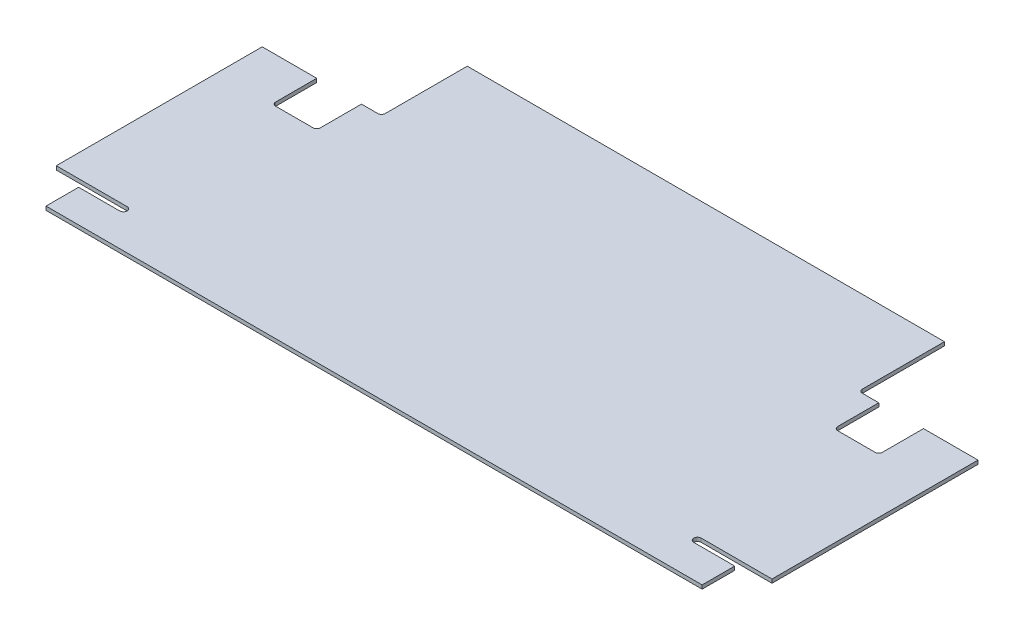
ISO-10303-21;
HEADER;
FILE_DESCRIPTION(('STEP AP214'),'2;1');
FILE_NAME('part.step','',(''),(''),'','','');
FILE_SCHEMA(('AUTOMOTIVE_DESIGN { 1 0 10303 214 1 1 1 1 }'));
ENDSEC;
DATA;
#1=APPLICATION_CONTEXT('core data for automotive mechanical design processes');
#2=APPLICATION_PROTOCOL_DEFINITION('international standard','automotive_design',2000,#1);
#3=PRODUCT_CONTEXT('',#1,'mechanical');
#4=PRODUCT('Part','Part','',(#3));
#5=PRODUCT_RELATED_PRODUCT_CATEGORY('part','',(#4));
#6=PRODUCT_DEFINITION_FORMATION('','',#4);
#7=PRODUCT_DEFINITION_CONTEXT('part definition',#1,'design');
#8=PRODUCT_DEFINITION('design','',#6,#7);
#9=PRODUCT_DEFINITION_SHAPE('','',#8);
#10=(LENGTH_UNIT() NAMED_UNIT(*) SI_UNIT(.MILLI.,.METRE.));
#11=(NAMED_UNIT(*) PLANE_ANGLE_UNIT() SI_UNIT($,.RADIAN.));
#12=(NAMED_UNIT(*) SI_UNIT($,.STERADIAN.) SOLID_ANGLE_UNIT());
#13=UNCERTAINTY_MEASURE_WITH_UNIT(LENGTH_MEASURE(1.E-05),#10,'distance_accuracy_value','');
#14=(GEOMETRIC_REPRESENTATION_CONTEXT(3) GLOBAL_UNCERTAINTY_ASSIGNED_CONTEXT((#13)) GLOBAL_UNIT_ASSIGNED_CONTEXT((#10,
#11,#12)) REPRESENTATION_CONTEXT('',''));
#15=CARTESIAN_POINT('',(0.,0.,0.));
#16=DIRECTION('',(0.,0.,1.));
#17=DIRECTION('',(1.,0.,0.));
#18=AXIS2_PLACEMENT_3D('',#15,#16,#17);
#19=CARTESIAN_POINT('',(304.8,3.175,152.4));
#20=DIRECTION('',(0.,1.,0.));
#21=DIRECTION('',(0.,0.,1.));
#22=AXIS2_PLACEMENT_3D('',#19,#20,#21);
#23=PLANE('',#22);
#24=DIRECTION('',(1.,0.,0.));
#25=VECTOR('',#24,1.);
#26=CARTESIAN_POINT('',(-304.8,3.175,152.4));
#27=LINE('',#26,#25);
#28=CARTESIAN_POINT('',(-279.4,3.175,152.4));
#29=VERTEX_POINT('',#28);
#30=CARTESIAN_POINT('',(279.4,3.175,152.4));
#31=VERTEX_POINT('',#30);
#32=EDGE_CURVE('E278',#29,#31,#27,.T.);
#33=ORIENTED_EDGE('',*,*,#32,.T.);
#34=DIRECTION('',(0.,0.,-1.));
#35=VECTOR('',#34,1.);
#36=CARTESIAN_POINT('',(279.4,3.175,152.4));
#37=LINE('',#36,#35);
#38=CARTESIAN_POINT('',(279.4,3.175,124.61875));
#39=VERTEX_POINT('',#38);
#40=EDGE_CURVE('E245',#31,#39,#37,.T.);
#41=ORIENTED_EDGE('',*,*,#40,.T.);
#42=DIRECTION('',(-1.,0.,0.));
#43=VECTOR('',#42,1.);
#44=CARTESIAN_POINT('',(279.4,3.175,124.61875));
#45=LINE('',#44,#43);
#46=CARTESIAN_POINT('',(244.475,3.175,124.61875));
#47=VERTEX_POINT('',#46);
#48=EDGE_CURVE('E366',#39,#47,#45,.T.);
#49=ORIENTED_EDGE('',*,*,#48,.T.);
#50=CARTESIAN_POINT('',(244.475,3.175,121.44375));
#51=DIRECTION('',(0.,1.,0.));
#52=DIRECTION('',(0.,0.,1.));
#53=AXIS2_PLACEMENT_3D('',#50,#51,#52);
#54=CIRCLE('',#53,3.175);
#55=CARTESIAN_POINT('',(241.3,3.175,121.44375));
#56=VERTEX_POINT('',#55);
#57=EDGE_CURVE('E52',#47,#56,#54,.F.);
#58=ORIENTED_EDGE('',*,*,#57,.T.);
#59=CARTESIAN_POINT('',(244.475,3.175,121.44375));
#60=DIRECTION('',(0.,1.,0.));
#61=DIRECTION('',(0.,0.,1.));
#62=AXIS2_PLACEMENT_3D('',#59,#60,#61);
#63=CIRCLE('',#62,3.175);
#64=CARTESIAN_POINT('',(244.475,3.175,118.26875));
#65=VERTEX_POINT('',#64);
#66=EDGE_CURVE('E39',#56,#65,#63,.F.);
#67=ORIENTED_EDGE('',*,*,#66,.T.);
#68=DIRECTION('',(1.,0.,0.));
#69=VECTOR('',#68,1.);
#70=CARTESIAN_POINT('',(304.8,3.175,118.26875));
#71=LINE('',#70,#69);
#72=CARTESIAN_POINT('',(304.8,3.175,118.26875));
#73=VERTEX_POINT('',#72);
#74=EDGE_CURVE('E259',#65,#73,#71,.T.);
#75=ORIENTED_EDGE('',*,*,#74,.T.);
#76=DIRECTION('',(0.,0.,-1.));
#77=VECTOR('',#76,1.);
#78=CARTESIAN_POINT('',(304.8,3.175,-152.4));
#79=LINE('',#78,#77);
#80=CARTESIAN_POINT('',(304.8,3.175,-57.1500000000001));
#81=VERTEX_POINT('',#80);
#82=EDGE_CURVE('E264',#73,#81,#79,.T.);
#83=ORIENTED_EDGE('',*,*,#82,.T.);
#84=DIRECTION('',(1.,0.,0.));
#85=VECTOR('',#84,1.);
#86=CARTESIAN_POINT('',(304.8,3.175,-57.1500000000001));
#87=LINE('',#86,#85);
#88=CARTESIAN_POINT('',(258.3815,3.175,-57.1500000000001));
#89=VERTEX_POINT('',#88);
#90=EDGE_CURVE('E469',#89,#81,#87,.T.);
#91=ORIENTED_EDGE('',*,*,#90,.F.);
#92=DIRECTION('',(0.,0.,-1.));
#93=VECTOR('',#92,1.);
#94=CARTESIAN_POINT('',(258.3815,3.175,-57.1500000000001));
#95=LINE('',#94,#93);
#96=CARTESIAN_POINT('',(258.3815,3.175,-22.2250000000001));
#97=VERTEX_POINT('',#96);
#98=EDGE_CURVE('E432',#97,#89,#95,.T.);
#99=ORIENTED_EDGE('',*,*,#98,.F.);
#100=CARTESIAN_POINT('',(255.2065,3.175,-22.2250000000001));
#101=DIRECTION('',(0.,1.,0.));
#102=DIRECTION('',(0.,0.,1.));
#103=AXIS2_PLACEMENT_3D('',#100,#101,#102);
#104=CIRCLE('',#103,3.175);
#105=CARTESIAN_POINT('',(255.2065,3.175,-19.0500000000001));
#106=VERTEX_POINT('',#105);
#107=EDGE_CURVE('E305',#97,#106,#104,.F.);
#108=ORIENTED_EDGE('',*,*,#107,.T.);
#109=DIRECTION('',(1.,0.,0.));
#110=VECTOR('',#109,1.);
#111=CARTESIAN_POINT('',(220.2815,3.175,-19.0500000000001));
#112=LINE('',#111,#110);
#113=CARTESIAN_POINT('',(223.4565,3.175,-19.0500000000001));
#114=VERTEX_POINT('',#113);
#115=EDGE_CURVE('E437',#114,#106,#112,.T.);
#116=ORIENTED_EDGE('',*,*,#115,.F.);
#117=CARTESIAN_POINT('',(223.4565,3.175,-22.2250000000001));
#118=DIRECTION('',(0.,1.,0.));
#119=DIRECTION('',(0.,0.,1.));
#120=AXIS2_PLACEMENT_3D('',#117,#118,#119);
#121=CIRCLE('',#120,3.175);
#122=CARTESIAN_POINT('',(220.2815,3.175,-22.2250000000001));
#123=VERTEX_POINT('',#122);
#124=EDGE_CURVE('E309',#114,#123,#121,.F.);
#125=ORIENTED_EDGE('',*,*,#124,.T.);
#126=DIRECTION('',(0.,0.,1.));
#127=VECTOR('',#126,1.);
#128=CARTESIAN_POINT('',(220.2815,3.175,-57.1500000000001));
#129=LINE('',#128,#127);
#130=CARTESIAN_POINT('',(220.2815,3.175,-57.1500000000001));
#131=VERTEX_POINT('',#130);
#132=EDGE_CURVE('E434',#131,#123,#129,.T.);
#133=ORIENTED_EDGE('',*,*,#132,.F.);
#134=CARTESIAN_POINT('',(206.375,3.175,-57.1500000000001));
#135=VERTEX_POINT('',#134);
#136=EDGE_CURVE('E470',#135,#131,#87,.T.);
#137=ORIENTED_EDGE('',*,*,#136,.F.);
#138=CARTESIAN_POINT('',(206.375,3.175,-60.3250000000001));
#139=DIRECTION('',(0.,1.,0.));
#140=DIRECTION('',(0.,0.,1.));
#141=AXIS2_PLACEMENT_3D('',#138,#139,#140);
#142=CIRCLE('',#141,3.175);
#143=CARTESIAN_POINT('',(203.2,3.175,-60.3250000000001));
#144=VERTEX_POINT('',#143);
#145=EDGE_CURVE('E285',#135,#144,#142,.F.);
#146=ORIENTED_EDGE('',*,*,#145,.T.);
#147=DIRECTION('',(0.,0.,1.));
#148=VECTOR('',#147,1.);
#149=CARTESIAN_POINT('',(203.2,3.175,-130.175));
#150=LINE('',#149,#148);
#151=CARTESIAN_POINT('',(203.2,3.175,-130.175));
#152=VERTEX_POINT('',#151);
#153=EDGE_CURVE('E466',#152,#144,#150,.T.);
#154=ORIENTED_EDGE('',*,*,#153,.F.);
#155=DIRECTION('',(1.,0.,0.));
#156=VECTOR('',#155,1.);
#157=CARTESIAN_POINT('',(-203.2,3.175,-130.175));
#158=LINE('',#157,#156);
#159=CARTESIAN_POINT('',(-203.2,3.175,-130.175));
#160=VERTEX_POINT('',#159);
#161=EDGE_CURVE('E463',#160,#152,#158,.T.);
#162=ORIENTED_EDGE('',*,*,#161,.F.);
#163=DIRECTION('',(0.,0.,-1.));
#164=VECTOR('',#163,1.);
#165=CARTESIAN_POINT('',(-203.2,3.175,-130.175));
#166=LINE('',#165,#164);
#167=CARTESIAN_POINT('',(-203.2,3.175,-60.325));
#168=VERTEX_POINT('',#167);
#169=EDGE_CURVE('E461',#168,#160,#166,.T.);
#170=ORIENTED_EDGE('',*,*,#169,.F.);
#171=CARTESIAN_POINT('',(-206.375,3.175,-60.325));
#172=DIRECTION('',(0.,1.,0.));
#173=DIRECTION('',(0.,0.,1.));
#174=AXIS2_PLACEMENT_3D('',#171,#172,#173);
#175=CIRCLE('',#174,3.175);
#176=CARTESIAN_POINT('',(-206.375,3.175,-57.15));
#177=VERTEX_POINT('',#176);
#178=EDGE_CURVE('E290',#168,#177,#175,.F.);
#179=ORIENTED_EDGE('',*,*,#178,.T.);
#180=DIRECTION('',(1.,0.,0.));
#181=VECTOR('',#180,1.);
#182=CARTESIAN_POINT('',(-304.8,3.175,-57.15));
#183=LINE('',#182,#181);
#184=CARTESIAN_POINT('',(-220.2815,3.175,-57.15));
#185=VERTEX_POINT('',#184);
#186=EDGE_CURVE('E457',#185,#177,#183,.T.);
#187=ORIENTED_EDGE('',*,*,#186,.F.);
#188=DIRECTION('',(0.,0.,1.));
#189=VECTOR('',#188,1.);
#190=CARTESIAN_POINT('',(-220.2815,3.175,-57.1500000000001));
#191=LINE('',#190,#189);
#192=CARTESIAN_POINT('',(-220.2815,3.175,-22.2250000000001));
#193=VERTEX_POINT('',#192);
#194=EDGE_CURVE('E412',#185,#193,#191,.T.);
#195=ORIENTED_EDGE('',*,*,#194,.T.);
#196=CARTESIAN_POINT('',(-223.4565,3.175,-22.2250000000001));
#197=DIRECTION('',(0.,1.,0.));
#198=DIRECTION('',(0.,0.,1.));
#199=AXIS2_PLACEMENT_3D('',#196,#197,#198);
#200=CIRCLE('',#199,3.175);
#201=CARTESIAN_POINT('',(-223.4565,3.175,-19.0500000000001));
#202=VERTEX_POINT('',#201);
#203=EDGE_CURVE('E327',#193,#202,#200,.F.);
#204=ORIENTED_EDGE('',*,*,#203,.T.);
#205=DIRECTION('',(-1.,0.,0.));
#206=VECTOR('',#205,1.);
#207=CARTESIAN_POINT('',(-220.2815,3.175,-19.0500000000001));
#208=LINE('',#207,#206);
#209=CARTESIAN_POINT('',(-255.2065,3.175,-19.0500000000001));
#210=VERTEX_POINT('',#209);
#211=EDGE_CURVE('E409',#202,#210,#208,.T.);
#212=ORIENTED_EDGE('',*,*,#211,.T.);
#213=CARTESIAN_POINT('',(-255.2065,3.175,-22.2250000000001));
#214=DIRECTION('',(0.,1.,0.));
#215=DIRECTION('',(0.,0.,1.));
#216=AXIS2_PLACEMENT_3D('',#213,#214,#215);
#217=CIRCLE('',#216,3.175);
#218=CARTESIAN_POINT('',(-258.3815,3.175,-22.2250000000001));
#219=VERTEX_POINT('',#218);
#220=EDGE_CURVE('E323',#210,#219,#217,.F.);
#221=ORIENTED_EDGE('',*,*,#220,.T.);
#222=DIRECTION('',(0.,0.,-1.));
#223=VECTOR('',#222,1.);
#224=CARTESIAN_POINT('',(-258.3815,3.175,-57.1500000000001));
#225=LINE('',#224,#223);
#226=CARTESIAN_POINT('',(-258.3815,3.175,-57.1500000000001));
#227=VERTEX_POINT('',#226);
#228=EDGE_CURVE('E407',#219,#227,#225,.T.);
#229=ORIENTED_EDGE('',*,*,#228,.T.);
#230=CARTESIAN_POINT('',(-304.8,3.175,-57.15));
#231=VERTEX_POINT('',#230);
#232=EDGE_CURVE('E458',#231,#227,#183,.T.);
#233=ORIENTED_EDGE('',*,*,#232,.F.);
#234=DIRECTION('',(0.,0.,1.));
#235=VECTOR('',#234,1.);
#236=CARTESIAN_POINT('',(-304.8,3.175,-152.4));
#237=LINE('',#236,#235);
#238=CARTESIAN_POINT('',(-304.8,3.175,118.26875));
#239=VERTEX_POINT('',#238);
#240=EDGE_CURVE('E267',#231,#239,#237,.T.);
#241=ORIENTED_EDGE('',*,*,#240,.T.);
#242=DIRECTION('',(-1.,0.,0.));
#243=VECTOR('',#242,1.);
#244=CARTESIAN_POINT('',(-304.8,3.175,118.26875));
#245=LINE('',#244,#243);
#246=CARTESIAN_POINT('',(-244.475,3.175,118.26875));
#247=VERTEX_POINT('',#246);
#248=EDGE_CURVE('E394',#247,#239,#245,.T.);
#249=ORIENTED_EDGE('',*,*,#248,.F.);
#250=CARTESIAN_POINT('',(-244.475,3.175,121.44375));
#251=DIRECTION('',(0.,1.,0.));
#252=DIRECTION('',(0.,0.,1.));
#253=AXIS2_PLACEMENT_3D('',#250,#251,#252);
#254=CIRCLE('',#253,3.175);
#255=CARTESIAN_POINT('',(-241.3,3.175,121.44375));
#256=VERTEX_POINT('',#255);
#257=EDGE_CURVE('E340',#247,#256,#254,.F.);
#258=ORIENTED_EDGE('',*,*,#257,.T.);
#259=CARTESIAN_POINT('',(-244.475,3.175,121.44375));
#260=DIRECTION('',(0.,1.,0.));
#261=DIRECTION('',(0.,0.,1.));
#262=AXIS2_PLACEMENT_3D('',#259,#260,#261);
#263=CIRCLE('',#262,3.175);
#264=CARTESIAN_POINT('',(-244.475,3.175,124.61875));
#265=VERTEX_POINT('',#264);
#266=EDGE_CURVE('E336',#256,#265,#263,.F.);
#267=ORIENTED_EDGE('',*,*,#266,.T.);
#268=DIRECTION('',(1.,0.,0.));
#269=VECTOR('',#268,1.);
#270=CARTESIAN_POINT('',(-279.4,3.175,124.61875));
#271=LINE('',#270,#269);
#272=CARTESIAN_POINT('',(-279.4,3.175,124.61875));
#273=VERTEX_POINT('',#272);
#274=EDGE_CURVE('E391',#273,#265,#271,.T.);
#275=ORIENTED_EDGE('',*,*,#274,.F.);
#276=DIRECTION('',(0.,0.,-1.));
#277=VECTOR('',#276,1.);
#278=CARTESIAN_POINT('',(-279.4,3.175,152.4));
#279=LINE('',#278,#277);
#280=EDGE_CURVE('E388',#29,#273,#279,.T.);
#281=ORIENTED_EDGE('',*,*,#280,.F.);
#282=EDGE_LOOP('',(#33,#41,#49,#58,#67,#75,#83,#91,#99,#108,#116,#125,#133,#137,#146,#154,#162,
#170,#179,#187,#195,#204,#212,#221,#229,#233,#241,#249,#258,#267,#275,#281));
#283=FACE_BOUND('',#282,.T.);
#284=ADVANCED_FACE('F30',(#283),#23,.T.);
#285=CARTESIAN_POINT('',(304.8,0.,152.4));
#286=DIRECTION('',(0.,1.,0.));
#287=DIRECTION('',(0.,0.,1.));
#288=AXIS2_PLACEMENT_3D('',#285,#286,#287);
#289=PLANE('',#288);
#290=DIRECTION('',(0.,0.,1.));
#291=VECTOR('',#290,1.);
#292=CARTESIAN_POINT('',(279.4,0.,152.4));
#293=LINE('',#292,#291);
#294=CARTESIAN_POINT('',(279.4,0.,124.61875));
#295=VERTEX_POINT('',#294);
#296=CARTESIAN_POINT('',(279.4,0.,152.4));
#297=VERTEX_POINT('',#296);
#298=EDGE_CURVE('E242',#295,#297,#293,.T.);
#299=ORIENTED_EDGE('',*,*,#298,.T.);
#300=DIRECTION('',(1.,0.,0.));
#301=VECTOR('',#300,1.);
#302=CARTESIAN_POINT('',(-304.8,0.,152.4));
#303=LINE('',#302,#301);
#304=CARTESIAN_POINT('',(-279.4,0.,152.4));
#305=VERTEX_POINT('',#304);
#306=EDGE_CURVE('E256',#305,#297,#303,.T.);
#307=ORIENTED_EDGE('',*,*,#306,.F.);
#308=DIRECTION('',(0.,0.,1.));
#309=VECTOR('',#308,1.);
#310=CARTESIAN_POINT('',(-279.4,0.,152.4));
#311=LINE('',#310,#309);
#312=CARTESIAN_POINT('',(-279.4,0.,124.61875));
#313=VERTEX_POINT('',#312);
#314=EDGE_CURVE('E348',#313,#305,#311,.T.);
#315=ORIENTED_EDGE('',*,*,#314,.F.);
#316=DIRECTION('',(-1.,0.,0.));
#317=VECTOR('',#316,1.);
#318=CARTESIAN_POINT('',(-279.4,0.,124.61875));
#319=LINE('',#318,#317);
#320=CARTESIAN_POINT('',(-244.475,0.,124.61875));
#321=VERTEX_POINT('',#320);
#322=EDGE_CURVE('E383',#321,#313,#319,.T.);
#323=ORIENTED_EDGE('',*,*,#322,.F.);
#324=CARTESIAN_POINT('',(-244.475,0.,121.44375));
#325=DIRECTION('',(0.,1.,0.));
#326=DIRECTION('',(0.,0.,1.));
#327=AXIS2_PLACEMENT_3D('',#324,#325,#326);
#328=CIRCLE('',#327,3.175);
#329=CARTESIAN_POINT('',(-241.3,0.,121.44375));
#330=VERTEX_POINT('',#329);
#331=EDGE_CURVE('E338',#321,#330,#328,.T.);
#332=ORIENTED_EDGE('',*,*,#331,.T.);
#333=CARTESIAN_POINT('',(-244.475,0.,121.44375));
#334=DIRECTION('',(0.,1.,0.));
#335=DIRECTION('',(0.,0.,1.));
#336=AXIS2_PLACEMENT_3D('',#333,#334,#335);
#337=CIRCLE('',#336,3.175);
#338=CARTESIAN_POINT('',(-244.475,0.,118.26875));
#339=VERTEX_POINT('',#338);
#340=EDGE_CURVE('E342',#330,#339,#337,.T.);
#341=ORIENTED_EDGE('',*,*,#340,.T.);
#342=DIRECTION('',(1.,0.,0.));
#343=VECTOR('',#342,1.);
#344=CARTESIAN_POINT('',(-304.8,0.,118.26875));
#345=LINE('',#344,#343);
#346=CARTESIAN_POINT('',(-304.8,0.,118.26875));
#347=VERTEX_POINT('',#346);
#348=EDGE_CURVE('E385',#347,#339,#345,.T.);
#349=ORIENTED_EDGE('',*,*,#348,.F.);
#350=DIRECTION('',(0.,0.,1.));
#351=VECTOR('',#350,1.);
#352=CARTESIAN_POINT('',(-304.8,0.,-152.4));
#353=LINE('',#352,#351);
#354=CARTESIAN_POINT('',(-304.8,0.,-57.15));
#355=VERTEX_POINT('',#354);
#356=EDGE_CURVE('E265',#355,#347,#353,.T.);
#357=ORIENTED_EDGE('',*,*,#356,.F.);
#358=DIRECTION('',(-1.,0.,0.));
#359=VECTOR('',#358,1.);
#360=CARTESIAN_POINT('',(-304.8,0.,-57.15));
#361=LINE('',#360,#359);
#362=CARTESIAN_POINT('',(-258.3815,0.,-57.15));
#363=VERTEX_POINT('',#362);
#364=EDGE_CURVE('E477',#363,#355,#361,.T.);
#365=ORIENTED_EDGE('',*,*,#364,.F.);
#366=DIRECTION('',(0.,0.,1.));
#367=VECTOR('',#366,1.);
#368=CARTESIAN_POINT('',(-258.3815,0.,-57.1500000000001));
#369=LINE('',#368,#367);
#370=CARTESIAN_POINT('',(-258.3815,0.,-22.2250000000001));
#371=VERTEX_POINT('',#370);
#372=EDGE_CURVE('E404',#363,#371,#369,.T.);
#373=ORIENTED_EDGE('',*,*,#372,.T.);
#374=CARTESIAN_POINT('',(-255.2065,0.,-22.2250000000001));
#375=DIRECTION('',(0.,1.,0.));
#376=DIRECTION('',(0.,0.,1.));
#377=AXIS2_PLACEMENT_3D('',#374,#375,#376);
#378=CIRCLE('',#377,3.175);
#379=CARTESIAN_POINT('',(-255.2065,0.,-19.0500000000001));
#380=VERTEX_POINT('',#379);
#381=EDGE_CURVE('E325',#371,#380,#378,.T.);
#382=ORIENTED_EDGE('',*,*,#381,.T.);
#383=DIRECTION('',(1.,0.,0.));
#384=VECTOR('',#383,1.);
#385=CARTESIAN_POINT('',(-220.2815,0.,-19.0500000000001));
#386=LINE('',#385,#384);
#387=CARTESIAN_POINT('',(-223.4565,0.,-19.0500000000001));
#388=VERTEX_POINT('',#387);
#389=EDGE_CURVE('E419',#380,#388,#386,.T.);
#390=ORIENTED_EDGE('',*,*,#389,.T.);
#391=CARTESIAN_POINT('',(-223.4565,0.,-22.2250000000001));
#392=DIRECTION('',(0.,1.,0.));
#393=DIRECTION('',(0.,0.,1.));
#394=AXIS2_PLACEMENT_3D('',#391,#392,#393);
#395=CIRCLE('',#394,3.175);
#396=CARTESIAN_POINT('',(-220.2815,0.,-22.2250000000001));
#397=VERTEX_POINT('',#396);
#398=EDGE_CURVE('E329',#388,#397,#395,.T.);
#399=ORIENTED_EDGE('',*,*,#398,.T.);
#400=DIRECTION('',(0.,0.,-1.));
#401=VECTOR('',#400,1.);
#402=CARTESIAN_POINT('',(-220.2815,0.,-57.1500000000001));
#403=LINE('',#402,#401);
#404=CARTESIAN_POINT('',(-220.2815,0.,-57.15));
#405=VERTEX_POINT('',#404);
#406=EDGE_CURVE('E399',#397,#405,#403,.T.);
#407=ORIENTED_EDGE('',*,*,#406,.T.);
#408=CARTESIAN_POINT('',(-206.375,0.,-57.15));
#409=VERTEX_POINT('',#408);
#410=EDGE_CURVE('E484',#409,#405,#361,.T.);
#411=ORIENTED_EDGE('',*,*,#410,.F.);
#412=CARTESIAN_POINT('',(-206.375,0.,-60.325));
#413=DIRECTION('',(0.,1.,0.));
#414=DIRECTION('',(0.,0.,1.));
#415=AXIS2_PLACEMENT_3D('',#412,#413,#414);
#416=CIRCLE('',#415,3.175);
#417=CARTESIAN_POINT('',(-203.2,0.,-60.325));
#418=VERTEX_POINT('',#417);
#419=EDGE_CURVE('E293',#409,#418,#416,.T.);
#420=ORIENTED_EDGE('',*,*,#419,.T.);
#421=DIRECTION('',(0.,0.,1.));
#422=VECTOR('',#421,1.);
#423=CARTESIAN_POINT('',(-203.2,0.,-130.175));
#424=LINE('',#423,#422);
#425=CARTESIAN_POINT('',(-203.2,0.,-130.175));
#426=VERTEX_POINT('',#425);
#427=EDGE_CURVE('E443',#426,#418,#424,.T.);
#428=ORIENTED_EDGE('',*,*,#427,.F.);
#429=DIRECTION('',(-1.,0.,0.));
#430=VECTOR('',#429,1.);
#431=CARTESIAN_POINT('',(-203.2,0.,-130.175));
#432=LINE('',#431,#430);
#433=CARTESIAN_POINT('',(203.2,0.,-130.175));
#434=VERTEX_POINT('',#433);
#435=EDGE_CURVE('E448',#434,#426,#432,.T.);
#436=ORIENTED_EDGE('',*,*,#435,.F.);
#437=DIRECTION('',(0.,0.,-1.));
#438=VECTOR('',#437,1.);
#439=CARTESIAN_POINT('',(203.2,0.,-130.175));
#440=LINE('',#439,#438);
#441=CARTESIAN_POINT('',(203.2,0.,-60.3250000000001));
#442=VERTEX_POINT('',#441);
#443=EDGE_CURVE('E451',#442,#434,#440,.T.);
#444=ORIENTED_EDGE('',*,*,#443,.F.);
#445=CARTESIAN_POINT('',(206.375,0.,-60.3250000000001));
#446=DIRECTION('',(0.,1.,0.));
#447=DIRECTION('',(0.,0.,1.));
#448=AXIS2_PLACEMENT_3D('',#445,#446,#447);
#449=CIRCLE('',#448,3.175);
#450=CARTESIAN_POINT('',(206.375,0.,-57.1500000000001));
#451=VERTEX_POINT('',#450);
#452=EDGE_CURVE('E287',#442,#451,#449,.T.);
#453=ORIENTED_EDGE('',*,*,#452,.T.);
#454=DIRECTION('',(-1.,0.,0.));
#455=VECTOR('',#454,1.);
#456=CARTESIAN_POINT('',(304.8,0.,-57.1500000000001));
#457=LINE('',#456,#455);
#458=CARTESIAN_POINT('',(220.2815,0.,-57.1500000000001));
#459=VERTEX_POINT('',#458);
#460=EDGE_CURVE('E453',#459,#451,#457,.T.);
#461=ORIENTED_EDGE('',*,*,#460,.F.);
#462=DIRECTION('',(0.,0.,-1.));
#463=VECTOR('',#462,1.);
#464=CARTESIAN_POINT('',(220.2815,0.,-57.1500000000001));
#465=LINE('',#464,#463);
#466=CARTESIAN_POINT('',(220.2815,0.,-22.2250000000001));
#467=VERTEX_POINT('',#466);
#468=EDGE_CURVE('E424',#467,#459,#465,.T.);
#469=ORIENTED_EDGE('',*,*,#468,.F.);
#470=CARTESIAN_POINT('',(223.4565,0.,-22.2250000000001));
#471=DIRECTION('',(0.,1.,0.));
#472=DIRECTION('',(0.,0.,1.));
#473=AXIS2_PLACEMENT_3D('',#470,#471,#472);
#474=CIRCLE('',#473,3.175);
#475=CARTESIAN_POINT('',(223.4565,0.,-19.0500000000001));
#476=VERTEX_POINT('',#475);
#477=EDGE_CURVE('E311',#467,#476,#474,.T.);
#478=ORIENTED_EDGE('',*,*,#477,.T.);
#479=DIRECTION('',(-1.,0.,0.));
#480=VECTOR('',#479,1.);
#481=CARTESIAN_POINT('',(220.2815,0.,-19.0500000000001));
#482=LINE('',#481,#480);
#483=CARTESIAN_POINT('',(255.2065,0.,-19.0500000000001));
#484=VERTEX_POINT('',#483);
#485=EDGE_CURVE('E426',#484,#476,#482,.T.);
#486=ORIENTED_EDGE('',*,*,#485,.F.);
#487=CARTESIAN_POINT('',(255.2065,0.,-22.2250000000001));
#488=DIRECTION('',(0.,1.,0.));
#489=DIRECTION('',(0.,0.,1.));
#490=AXIS2_PLACEMENT_3D('',#487,#488,#489);
#491=CIRCLE('',#490,3.175);
#492=CARTESIAN_POINT('',(258.3815,0.,-22.2250000000001));
#493=VERTEX_POINT('',#492);
#494=EDGE_CURVE('E307',#484,#493,#491,.T.);
#495=ORIENTED_EDGE('',*,*,#494,.T.);
#496=DIRECTION('',(0.,0.,1.));
#497=VECTOR('',#496,1.);
#498=CARTESIAN_POINT('',(258.3815,0.,-57.1500000000001));
#499=LINE('',#498,#497);
#500=CARTESIAN_POINT('',(258.3815,0.,-57.1500000000001));
#501=VERTEX_POINT('',#500);
#502=EDGE_CURVE('E429',#501,#493,#499,.T.);
#503=ORIENTED_EDGE('',*,*,#502,.F.);
#504=CARTESIAN_POINT('',(304.8,0.,-57.1500000000001));
#505=VERTEX_POINT('',#504);
#506=EDGE_CURVE('E454',#505,#501,#457,.T.);
#507=ORIENTED_EDGE('',*,*,#506,.F.);
#508=DIRECTION('',(0.,0.,-1.));
#509=VECTOR('',#508,1.);
#510=CARTESIAN_POINT('',(304.8,0.,-152.4));
#511=LINE('',#510,#509);
#512=CARTESIAN_POINT('',(304.8,0.,118.26875));
#513=VERTEX_POINT('',#512);
#514=EDGE_CURVE('E270',#513,#505,#511,.T.);
#515=ORIENTED_EDGE('',*,*,#514,.F.);
#516=DIRECTION('',(-1.,0.,0.));
#517=VECTOR('',#516,1.);
#518=CARTESIAN_POINT('',(304.8,0.,118.26875));
#519=LINE('',#518,#517);
#520=CARTESIAN_POINT('',(244.475,0.,118.26875));
#521=VERTEX_POINT('',#520);
#522=EDGE_CURVE('E250',#513,#521,#519,.T.);
#523=ORIENTED_EDGE('',*,*,#522,.T.);
#524=CARTESIAN_POINT('',(244.475,0.,121.44375));
#525=DIRECTION('',(0.,1.,0.));
#526=DIRECTION('',(0.,0.,1.));
#527=AXIS2_PLACEMENT_3D('',#524,#525,#526);
#528=CIRCLE('',#527,3.175);
#529=CARTESIAN_POINT('',(241.3,0.,121.44375));
#530=VERTEX_POINT('',#529);
#531=EDGE_CURVE('E11',#521,#530,#528,.T.);
#532=ORIENTED_EDGE('',*,*,#531,.T.);
#533=CARTESIAN_POINT('',(244.475,0.,121.44375));
#534=DIRECTION('',(0.,1.,0.));
#535=DIRECTION('',(0.,0.,1.));
#536=AXIS2_PLACEMENT_3D('',#533,#534,#535);
#537=CIRCLE('',#536,3.175);
#538=CARTESIAN_POINT('',(244.475,0.,124.61875));
#539=VERTEX_POINT('',#538);
#540=EDGE_CURVE('E354',#530,#539,#537,.T.);
#541=ORIENTED_EDGE('',*,*,#540,.T.);
#542=DIRECTION('',(1.,0.,0.));
#543=VECTOR('',#542,1.);
#544=CARTESIAN_POINT('',(279.4,0.,124.61875));
#545=LINE('',#544,#543);
#546=EDGE_CURVE('E258',#539,#295,#545,.T.);
#547=ORIENTED_EDGE('',*,*,#546,.T.);
#548=EDGE_LOOP('',(#299,#307,#315,#323,#332,#341,#349,#357,#365,#373,#382,#390,#399,#407,#411,
#420,#428,#436,#444,#453,#461,#469,#478,#486,#495,#503,#507,#515,#523,#532,#541,#547));
#549=FACE_BOUND('',#548,.T.);
#550=ADVANCED_FACE('F254',(#549),#289,.F.);
#551=CARTESIAN_POINT('',(304.8,3.175,-152.4));
#552=DIRECTION('',(-1.,0.,0.));
#553=DIRECTION('',(0.,0.,1.));
#554=AXIS2_PLACEMENT_3D('',#551,#552,#553);
#555=PLANE('',#554);
#556=DIRECTION('',(0.,1.,0.));
#557=VECTOR('',#556,1.);
#558=CARTESIAN_POINT('',(304.8,-0.00100000000000013,118.26875));
#559=LINE('',#558,#557);
#560=EDGE_CURVE('E364',#513,#73,#559,.T.);
#561=ORIENTED_EDGE('',*,*,#560,.F.);
#562=ORIENTED_EDGE('',*,*,#514,.T.);
#563=DIRECTION('',(0.,1.,0.));
#564=VECTOR('',#563,1.);
#565=CARTESIAN_POINT('',(304.8,-0.00100000000000013,-57.1500000000001));
#566=LINE('',#565,#564);
#567=EDGE_CURVE('E474',#505,#81,#566,.T.);
#568=ORIENTED_EDGE('',*,*,#567,.T.);
#569=ORIENTED_EDGE('',*,*,#82,.F.);
#570=EDGE_LOOP('',(#561,#562,#568,#569));
#571=FACE_BOUND('',#570,.T.);
#572=ADVANCED_FACE('F492',(#571),#555,.F.);
#573=CARTESIAN_POINT('',(-304.8,3.175,152.4));
#574=DIRECTION('',(0.,0.,-1.));
#575=DIRECTION('',(-1.,0.,0.));
#576=AXIS2_PLACEMENT_3D('',#573,#574,#575);
#577=PLANE('',#576);
#578=DIRECTION('',(0.,1.,0.));
#579=VECTOR('',#578,1.);
#580=CARTESIAN_POINT('',(279.4,-0.00100000000000013,152.4));
#581=LINE('',#580,#579);
#582=EDGE_CURVE('E239',#297,#31,#581,.T.);
#583=ORIENTED_EDGE('',*,*,#582,.T.);
#584=ORIENTED_EDGE('',*,*,#32,.F.);
#585=DIRECTION('',(0.,1.,0.));
#586=VECTOR('',#585,1.);
#587=CARTESIAN_POINT('',(-279.4,-0.00100000000000013,152.4));
#588=LINE('',#587,#586);
#589=EDGE_CURVE('E263',#305,#29,#588,.T.);
#590=ORIENTED_EDGE('',*,*,#589,.F.);
#591=ORIENTED_EDGE('',*,*,#306,.T.);
#592=EDGE_LOOP('',(#583,#584,#590,#591));
#593=FACE_BOUND('',#592,.T.);
#594=ADVANCED_FACE('F262',(#593),#577,.F.);
#595=CARTESIAN_POINT('',(-304.8,-0.00100000000000013,-57.15));
#596=DIRECTION('',(0.,0.,1.));
#597=DIRECTION('',(1.,0.,0.));
#598=AXIS2_PLACEMENT_3D('',#595,#596,#597);
#599=PLANE('',#598);
#600=DIRECTION('',(0.,1.,0.));
#601=VECTOR('',#600,1.);
#602=CARTESIAN_POINT('',(-258.3815,-0.00100000000000013,-57.1500000000001));
#603=LINE('',#602,#601);
#604=EDGE_CURVE('E416',#363,#227,#603,.T.);
#605=ORIENTED_EDGE('',*,*,#604,.F.);
#606=ORIENTED_EDGE('',*,*,#364,.T.);
#607=DIRECTION('',(0.,1.,0.));
#608=VECTOR('',#607,1.);
#609=CARTESIAN_POINT('',(-304.8,-0.00100000000000013,-57.15));
#610=LINE('',#609,#608);
#611=EDGE_CURVE('E473',#355,#231,#610,.T.);
#612=ORIENTED_EDGE('',*,*,#611,.T.);
#613=ORIENTED_EDGE('',*,*,#232,.T.);
#614=EDGE_LOOP('',(#605,#606,#612,#613));
#615=FACE_BOUND('',#614,.T.);
#616=ADVANCED_FACE('F587',(#615),#599,.F.);
#617=DIRECTION('',(0.,1.,0.));
#618=VECTOR('',#617,1.);
#619=CARTESIAN_POINT('',(-220.2815,-0.00100000000000013,-57.1500000000001));
#620=LINE('',#619,#618);
#621=EDGE_CURVE('E415',#405,#185,#620,.T.);
#622=ORIENTED_EDGE('',*,*,#621,.T.);
#623=ORIENTED_EDGE('',*,*,#186,.T.);
#624=DIRECTION('',(0.,1.,0.));
#625=VECTOR('',#624,1.);
#626=CARTESIAN_POINT('',(-206.375,0.,-57.15));
#627=LINE('',#626,#625);
#628=EDGE_CURVE('E283',#177,#409,#627,.F.);
#629=ORIENTED_EDGE('',*,*,#628,.T.);
#630=ORIENTED_EDGE('',*,*,#410,.T.);
#631=EDGE_LOOP('',(#622,#623,#629,#630));
#632=FACE_BOUND('',#631,.T.);
#633=ADVANCED_FACE('F551',(#632),#599,.F.);
#634=CARTESIAN_POINT('',(304.8,-0.00100000000000013,-57.1500000000001));
#635=DIRECTION('',(0.,0.,1.));
#636=DIRECTION('',(1.,0.,0.));
#637=AXIS2_PLACEMENT_3D('',#634,#635,#636);
#638=PLANE('',#637);
#639=ORIENTED_EDGE('',*,*,#506,.T.);
#640=DIRECTION('',(0.,1.,0.));
#641=VECTOR('',#640,1.);
#642=CARTESIAN_POINT('',(258.3815,-0.00100000000000013,-57.1500000000001));
#643=LINE('',#642,#641);
#644=EDGE_CURVE('E440',#501,#89,#643,.T.);
#645=ORIENTED_EDGE('',*,*,#644,.T.);
#646=ORIENTED_EDGE('',*,*,#90,.T.);
#647=ORIENTED_EDGE('',*,*,#567,.F.);
#648=EDGE_LOOP('',(#639,#645,#646,#647));
#649=FACE_BOUND('',#648,.T.);
#650=ADVANCED_FACE('F496',(#649),#638,.F.);
#651=CARTESIAN_POINT('',(-304.8,3.175,-152.4));
#652=DIRECTION('',(1.,0.,0.));
#653=DIRECTION('',(0.,0.,-1.));
#654=AXIS2_PLACEMENT_3D('',#651,#652,#653);
#655=PLANE('',#654);
#656=ORIENTED_EDGE('',*,*,#356,.T.);
#657=DIRECTION('',(0.,1.,0.));
#658=VECTOR('',#657,1.);
#659=CARTESIAN_POINT('',(-304.8,-0.00100000000000013,118.26875));
#660=LINE('',#659,#658);
#661=EDGE_CURVE('E396',#347,#239,#660,.T.);
#662=ORIENTED_EDGE('',*,*,#661,.T.);
#663=ORIENTED_EDGE('',*,*,#240,.F.);
#664=ORIENTED_EDGE('',*,*,#611,.F.);
#665=EDGE_LOOP('',(#656,#662,#663,#664));
#666=FACE_BOUND('',#665,.T.);
#667=ADVANCED_FACE('F592',(#666),#655,.F.);
#668=ORIENTED_EDGE('',*,*,#136,.T.);
#669=DIRECTION('',(0.,1.,0.));
#670=VECTOR('',#669,1.);
#671=CARTESIAN_POINT('',(220.2815,-0.00100000000000013,-57.1500000000001));
#672=LINE('',#671,#670);
#673=EDGE_CURVE('E441',#459,#131,#672,.T.);
#674=ORIENTED_EDGE('',*,*,#673,.F.);
#675=ORIENTED_EDGE('',*,*,#460,.T.);
#676=DIRECTION('',(0.,1.,0.));
#677=VECTOR('',#676,1.);
#678=CARTESIAN_POINT('',(206.375,3.175,-57.1500000000001));
#679=LINE('',#678,#677);
#680=EDGE_CURVE('E274',#451,#135,#679,.T.);
#681=ORIENTED_EDGE('',*,*,#680,.T.);
#682=EDGE_LOOP('',(#668,#674,#675,#681));
#683=FACE_BOUND('',#682,.T.);
#684=ADVANCED_FACE('F524',(#683),#638,.F.);
#685=CARTESIAN_POINT('',(203.2,-0.00100000000000013,-130.175));
#686=DIRECTION('',(-1.,0.,0.));
#687=DIRECTION('',(0.,0.,1.));
#688=AXIS2_PLACEMENT_3D('',#685,#686,#687);
#689=PLANE('',#688);
#690=ORIENTED_EDGE('',*,*,#153,.T.);
#691=DIRECTION('',(0.,1.,0.));
#692=VECTOR('',#691,1.);
#693=CARTESIAN_POINT('',(203.2,0.,-60.3250000000001));
#694=LINE('',#693,#692);
#695=EDGE_CURVE('E277',#144,#442,#694,.F.);
#696=ORIENTED_EDGE('',*,*,#695,.T.);
#697=ORIENTED_EDGE('',*,*,#443,.T.);
#698=DIRECTION('',(0.,1.,0.));
#699=VECTOR('',#698,1.);
#700=CARTESIAN_POINT('',(203.2,-0.00100000000000013,-130.175));
#701=LINE('',#700,#699);
#702=EDGE_CURVE('E478',#434,#152,#701,.T.);
#703=ORIENTED_EDGE('',*,*,#702,.T.);
#704=EDGE_LOOP('',(#690,#696,#697,#703));
#705=FACE_BOUND('',#704,.T.);
#706=ADVANCED_FACE('F535',(#705),#689,.F.);
#707=CARTESIAN_POINT('',(-203.2,-0.00100000000000013,-130.175));
#708=DIRECTION('',(0.,0.,1.));
#709=DIRECTION('',(1.,0.,0.));
#710=AXIS2_PLACEMENT_3D('',#707,#708,#709);
#711=PLANE('',#710);
#712=ORIENTED_EDGE('',*,*,#435,.T.);
#713=DIRECTION('',(0.,1.,0.));
#714=VECTOR('',#713,1.);
#715=CARTESIAN_POINT('',(-203.2,-0.00100000000000013,-130.175));
#716=LINE('',#715,#714);
#717=EDGE_CURVE('E480',#426,#160,#716,.T.);
#718=ORIENTED_EDGE('',*,*,#717,.T.);
#719=ORIENTED_EDGE('',*,*,#161,.T.);
#720=ORIENTED_EDGE('',*,*,#702,.F.);
#721=EDGE_LOOP('',(#712,#718,#719,#720));
#722=FACE_BOUND('',#721,.T.);
#723=ADVANCED_FACE('F538',(#722),#711,.F.);
#724=CARTESIAN_POINT('',(-203.2,-0.00100000000000013,-130.175));
#725=DIRECTION('',(1.,0.,0.));
#726=DIRECTION('',(0.,0.,-1.));
#727=AXIS2_PLACEMENT_3D('',#724,#725,#726);
#728=PLANE('',#727);
#729=ORIENTED_EDGE('',*,*,#427,.T.);
#730=DIRECTION('',(0.,1.,0.));
#731=VECTOR('',#730,1.);
#732=CARTESIAN_POINT('',(-203.2,3.175,-60.325));
#733=LINE('',#732,#731);
#734=EDGE_CURVE('E280',#418,#168,#733,.T.);
#735=ORIENTED_EDGE('',*,*,#734,.T.);
#736=ORIENTED_EDGE('',*,*,#169,.T.);
#737=ORIENTED_EDGE('',*,*,#717,.F.);
#738=EDGE_LOOP('',(#729,#735,#736,#737));
#739=FACE_BOUND('',#738,.T.);
#740=ADVANCED_FACE('F543',(#739),#728,.F.);
#741=CARTESIAN_POINT('',(206.375,-0.00100000000000013,-60.3250000000001));
#742=DIRECTION('',(0.,-1.,0.));
#743=DIRECTION('',(0.,0.,-1.));
#744=AXIS2_PLACEMENT_3D('',#741,#742,#743);
#745=CYLINDRICAL_SURFACE('',#744,3.175);
#746=ORIENTED_EDGE('',*,*,#452,.F.);
#747=ORIENTED_EDGE('',*,*,#695,.F.);
#748=ORIENTED_EDGE('',*,*,#145,.F.);
#749=ORIENTED_EDGE('',*,*,#680,.F.);
#750=EDGE_LOOP('',(#746,#747,#748,#749));
#751=FACE_BOUND('',#750,.T.);
#752=ADVANCED_FACE('F531',(#751),#745,.F.);
#753=CARTESIAN_POINT('',(-206.375,-0.00100000000000013,-60.325));
#754=DIRECTION('',(0.,-1.,0.));
#755=DIRECTION('',(0.,0.,-1.));
#756=AXIS2_PLACEMENT_3D('',#753,#754,#755);
#757=CYLINDRICAL_SURFACE('',#756,3.175);
#758=ORIENTED_EDGE('',*,*,#419,.F.);
#759=ORIENTED_EDGE('',*,*,#628,.F.);
#760=ORIENTED_EDGE('',*,*,#178,.F.);
#761=ORIENTED_EDGE('',*,*,#734,.F.);
#762=EDGE_LOOP('',(#758,#759,#760,#761));
#763=FACE_BOUND('',#762,.T.);
#764=ADVANCED_FACE('F548',(#763),#757,.F.);
#765=CARTESIAN_POINT('',(258.3815,-0.00100000000000013,-57.1500000000001));
#766=DIRECTION('',(1.,0.,0.));
#767=DIRECTION('',(0.,0.,-1.));
#768=AXIS2_PLACEMENT_3D('',#765,#766,#767);
#769=PLANE('',#768);
#770=ORIENTED_EDGE('',*,*,#502,.T.);
#771=DIRECTION('',(0.,1.,0.));
#772=VECTOR('',#771,1.);
#773=CARTESIAN_POINT('',(258.3815,3.175,-22.2250000000001));
#774=LINE('',#773,#772);
#775=EDGE_CURVE('E295',#493,#97,#774,.T.);
#776=ORIENTED_EDGE('',*,*,#775,.T.);
#777=ORIENTED_EDGE('',*,*,#98,.T.);
#778=ORIENTED_EDGE('',*,*,#644,.F.);
#779=EDGE_LOOP('',(#770,#776,#777,#778));
#780=FACE_BOUND('',#779,.T.);
#781=ADVANCED_FACE('F503',(#780),#769,.F.);
#782=CARTESIAN_POINT('',(220.2815,-0.00100000000000013,-19.0500000000001));
#783=DIRECTION('',(0.,0.,1.));
#784=DIRECTION('',(1.,0.,0.));
#785=AXIS2_PLACEMENT_3D('',#782,#783,#784);
#786=PLANE('',#785);
#787=ORIENTED_EDGE('',*,*,#115,.T.);
#788=DIRECTION('',(0.,1.,0.));
#789=VECTOR('',#788,1.);
#790=CARTESIAN_POINT('',(255.2065,0.,-19.0500000000001));
#791=LINE('',#790,#789);
#792=EDGE_CURVE('E301',#106,#484,#791,.F.);
#793=ORIENTED_EDGE('',*,*,#792,.T.);
#794=ORIENTED_EDGE('',*,*,#485,.T.);
#795=DIRECTION('',(0.,1.,0.));
#796=VECTOR('',#795,1.);
#797=CARTESIAN_POINT('',(223.4565,3.175,-19.0500000000001));
#798=LINE('',#797,#796);
#799=EDGE_CURVE('E298',#476,#114,#798,.T.);
#800=ORIENTED_EDGE('',*,*,#799,.T.);
#801=EDGE_LOOP('',(#787,#793,#794,#800));
#802=FACE_BOUND('',#801,.T.);
#803=ADVANCED_FACE('F510',(#802),#786,.F.);
#804=CARTESIAN_POINT('',(220.2815,-0.00100000000000013,-57.1500000000001));
#805=DIRECTION('',(-1.,0.,0.));
#806=DIRECTION('',(0.,0.,1.));
#807=AXIS2_PLACEMENT_3D('',#804,#805,#806);
#808=PLANE('',#807);
#809=ORIENTED_EDGE('',*,*,#132,.T.);
#810=DIRECTION('',(0.,1.,0.));
#811=VECTOR('',#810,1.);
#812=CARTESIAN_POINT('',(220.2815,0.,-22.2250000000001));
#813=LINE('',#812,#811);
#814=EDGE_CURVE('E303',#123,#467,#813,.F.);
#815=ORIENTED_EDGE('',*,*,#814,.T.);
#816=ORIENTED_EDGE('',*,*,#468,.T.);
#817=ORIENTED_EDGE('',*,*,#673,.T.);
#818=EDGE_LOOP('',(#809,#815,#816,#817));
#819=FACE_BOUND('',#818,.T.);
#820=ADVANCED_FACE('F519',(#819),#808,.F.);
#821=CARTESIAN_POINT('',(255.2065,-0.00100000000000013,-22.2250000000001));
#822=DIRECTION('',(0.,-1.,0.));
#823=DIRECTION('',(0.,0.,-1.));
#824=AXIS2_PLACEMENT_3D('',#821,#822,#823);
#825=CYLINDRICAL_SURFACE('',#824,3.175);
#826=ORIENTED_EDGE('',*,*,#494,.F.);
#827=ORIENTED_EDGE('',*,*,#792,.F.);
#828=ORIENTED_EDGE('',*,*,#107,.F.);
#829=ORIENTED_EDGE('',*,*,#775,.F.);
#830=EDGE_LOOP('',(#826,#827,#828,#829));
#831=FACE_BOUND('',#830,.T.);
#832=ADVANCED_FACE('F506',(#831),#825,.F.);
#833=CARTESIAN_POINT('',(223.4565,-0.00100000000000013,-22.2250000000001));
#834=DIRECTION('',(0.,-1.,0.));
#835=DIRECTION('',(0.,0.,-1.));
#836=AXIS2_PLACEMENT_3D('',#833,#834,#835);
#837=CYLINDRICAL_SURFACE('',#836,3.175);
#838=ORIENTED_EDGE('',*,*,#477,.F.);
#839=ORIENTED_EDGE('',*,*,#814,.F.);
#840=ORIENTED_EDGE('',*,*,#124,.F.);
#841=ORIENTED_EDGE('',*,*,#799,.F.);
#842=EDGE_LOOP('',(#838,#839,#840,#841));
#843=FACE_BOUND('',#842,.T.);
#844=ADVANCED_FACE('F514',(#843),#837,.F.);
#845=CARTESIAN_POINT('',(-258.3815,-0.00100000000000013,-57.1500000000001));
#846=DIRECTION('',(1.,0.,0.));
#847=DIRECTION('',(0.,0.,-1.));
#848=AXIS2_PLACEMENT_3D('',#845,#846,#847);
#849=PLANE('',#848);
#850=ORIENTED_EDGE('',*,*,#228,.F.);
#851=DIRECTION('',(0.,1.,0.));
#852=VECTOR('',#851,1.);
#853=CARTESIAN_POINT('',(-258.3815,0.,-22.2250000000001));
#854=LINE('',#853,#852);
#855=EDGE_CURVE('E318',#219,#371,#854,.F.);
#856=ORIENTED_EDGE('',*,*,#855,.T.);
#857=ORIENTED_EDGE('',*,*,#372,.F.);
#858=ORIENTED_EDGE('',*,*,#604,.T.);
#859=EDGE_LOOP('',(#850,#856,#857,#858));
#860=FACE_BOUND('',#859,.T.);
#861=ADVANCED_FACE('F605',(#860),#849,.T.);
#862=CARTESIAN_POINT('',(-220.2815,-0.00100000000000013,-57.1500000000001));
#863=DIRECTION('',(-1.,0.,0.));
#864=DIRECTION('',(0.,0.,1.));
#865=AXIS2_PLACEMENT_3D('',#862,#863,#864);
#866=PLANE('',#865);
#867=ORIENTED_EDGE('',*,*,#406,.F.);
#868=DIRECTION('',(0.,1.,0.));
#869=VECTOR('',#868,1.);
#870=CARTESIAN_POINT('',(-220.2815,3.175,-22.2250000000001));
#871=LINE('',#870,#869);
#872=EDGE_CURVE('E320',#397,#193,#871,.T.);
#873=ORIENTED_EDGE('',*,*,#872,.T.);
#874=ORIENTED_EDGE('',*,*,#194,.F.);
#875=ORIENTED_EDGE('',*,*,#621,.F.);
#876=EDGE_LOOP('',(#867,#873,#874,#875));
#877=FACE_BOUND('',#876,.T.);
#878=ADVANCED_FACE('F557',(#877),#866,.T.);
#879=CARTESIAN_POINT('',(-220.2815,-0.00100000000000013,-19.0500000000001));
#880=DIRECTION('',(0.,0.,-1.));
#881=DIRECTION('',(-1.,0.,0.));
#882=AXIS2_PLACEMENT_3D('',#879,#880,#881);
#883=PLANE('',#882);
#884=ORIENTED_EDGE('',*,*,#389,.F.);
#885=DIRECTION('',(0.,1.,0.));
#886=VECTOR('',#885,1.);
#887=CARTESIAN_POINT('',(-255.2065,3.175,-19.0500000000001));
#888=LINE('',#887,#886);
#889=EDGE_CURVE('E315',#380,#210,#888,.T.);
#890=ORIENTED_EDGE('',*,*,#889,.T.);
#891=ORIENTED_EDGE('',*,*,#211,.F.);
#892=DIRECTION('',(0.,1.,0.));
#893=VECTOR('',#892,1.);
#894=CARTESIAN_POINT('',(-223.4565,0.,-19.0500000000001));
#895=LINE('',#894,#893);
#896=EDGE_CURVE('E313',#202,#388,#895,.F.);
#897=ORIENTED_EDGE('',*,*,#896,.T.);
#898=EDGE_LOOP('',(#884,#890,#891,#897));
#899=FACE_BOUND('',#898,.T.);
#900=ADVANCED_FACE('F563',(#899),#883,.T.);
#901=CARTESIAN_POINT('',(-255.2065,-0.00100000000000013,-22.2250000000001));
#902=DIRECTION('',(0.,-1.,0.));
#903=DIRECTION('',(0.,0.,-1.));
#904=AXIS2_PLACEMENT_3D('',#901,#902,#903);
#905=CYLINDRICAL_SURFACE('',#904,3.175);
#906=ORIENTED_EDGE('',*,*,#381,.F.);
#907=ORIENTED_EDGE('',*,*,#855,.F.);
#908=ORIENTED_EDGE('',*,*,#220,.F.);
#909=ORIENTED_EDGE('',*,*,#889,.F.);
#910=EDGE_LOOP('',(#906,#907,#908,#909));
#911=FACE_BOUND('',#910,.T.);
#912=ADVANCED_FACE('F568',(#911),#905,.F.);
#913=CARTESIAN_POINT('',(-223.4565,-0.00100000000000013,-22.2250000000001));
#914=DIRECTION('',(0.,-1.,0.));
#915=DIRECTION('',(0.,0.,-1.));
#916=AXIS2_PLACEMENT_3D('',#913,#914,#915);
#917=CYLINDRICAL_SURFACE('',#916,3.175);
#918=ORIENTED_EDGE('',*,*,#398,.F.);
#919=ORIENTED_EDGE('',*,*,#896,.F.);
#920=ORIENTED_EDGE('',*,*,#203,.F.);
#921=ORIENTED_EDGE('',*,*,#872,.F.);
#922=EDGE_LOOP('',(#918,#919,#920,#921));
#923=FACE_BOUND('',#922,.T.);
#924=ADVANCED_FACE('F565',(#923),#917,.F.);
#925=CARTESIAN_POINT('',(-304.8,-0.00100000000000013,118.26875));
#926=DIRECTION('',(0.,0.,-1.));
#927=DIRECTION('',(-1.,0.,0.));
#928=AXIS2_PLACEMENT_3D('',#925,#926,#927);
#929=PLANE('',#928);
#930=ORIENTED_EDGE('',*,*,#348,.T.);
#931=DIRECTION('',(0.,1.,0.));
#932=VECTOR('',#931,1.);
#933=CARTESIAN_POINT('',(-244.475,3.175,118.26875));
#934=LINE('',#933,#932);
#935=EDGE_CURVE('E334',#339,#247,#934,.T.);
#936=ORIENTED_EDGE('',*,*,#935,.T.);
#937=ORIENTED_EDGE('',*,*,#248,.T.);
#938=ORIENTED_EDGE('',*,*,#661,.F.);
#939=EDGE_LOOP('',(#930,#936,#937,#938));
#940=FACE_BOUND('',#939,.T.);
#941=ADVANCED_FACE('F567',(#940),#929,.F.);
#942=CARTESIAN_POINT('',(-279.4,-0.00100000000000013,124.61875));
#943=DIRECTION('',(0.,0.,1.));
#944=DIRECTION('',(1.,0.,0.));
#945=AXIS2_PLACEMENT_3D('',#942,#943,#944);
#946=PLANE('',#945);
#947=ORIENTED_EDGE('',*,*,#274,.T.);
#948=DIRECTION('',(0.,1.,0.));
#949=VECTOR('',#948,1.);
#950=CARTESIAN_POINT('',(-244.475,0.,124.61875));
#951=LINE('',#950,#949);
#952=EDGE_CURVE('E331',#265,#321,#951,.F.);
#953=ORIENTED_EDGE('',*,*,#952,.T.);
#954=ORIENTED_EDGE('',*,*,#322,.T.);
#955=DIRECTION('',(0.,1.,0.));
#956=VECTOR('',#955,1.);
#957=CARTESIAN_POINT('',(-279.4,-0.00100000000000013,124.61875));
#958=LINE('',#957,#956);
#959=EDGE_CURVE('E400',#313,#273,#958,.T.);
#960=ORIENTED_EDGE('',*,*,#959,.T.);
#961=EDGE_LOOP('',(#947,#953,#954,#960));
#962=FACE_BOUND('',#961,.T.);
#963=ADVANCED_FACE('F574',(#962),#946,.F.);
#964=CARTESIAN_POINT('',(-279.4,-0.00100000000000013,152.4));
#965=DIRECTION('',(1.,0.,0.));
#966=DIRECTION('',(0.,0.,-1.));
#967=AXIS2_PLACEMENT_3D('',#964,#965,#966);
#968=PLANE('',#967);
#969=ORIENTED_EDGE('',*,*,#314,.T.);
#970=ORIENTED_EDGE('',*,*,#589,.T.);
#971=ORIENTED_EDGE('',*,*,#280,.T.);
#972=ORIENTED_EDGE('',*,*,#959,.F.);
#973=EDGE_LOOP('',(#969,#970,#971,#972));
#974=FACE_BOUND('',#973,.T.);
#975=ADVANCED_FACE('F721',(#974),#968,.F.);
#976=CARTESIAN_POINT('',(-244.475,-0.00100000000000013,121.44375));
#977=DIRECTION('',(0.,-1.,0.));
#978=DIRECTION('',(0.,0.,-1.));
#979=AXIS2_PLACEMENT_3D('',#976,#977,#978);
#980=CYLINDRICAL_SURFACE('',#979,3.175);
#981=ORIENTED_EDGE('',*,*,#935,.F.);
#982=ORIENTED_EDGE('',*,*,#340,.F.);
#983=DIRECTION('',(0.,1.,0.));
#984=VECTOR('',#983,1.);
#985=CARTESIAN_POINT('',(-241.3,0.,121.44375));
#986=LINE('',#985,#984);
#987=EDGE_CURVE('E345',#256,#330,#986,.F.);
#988=ORIENTED_EDGE('',*,*,#987,.F.);
#989=ORIENTED_EDGE('',*,*,#257,.F.);
#990=EDGE_LOOP('',(#981,#982,#988,#989));
#991=FACE_BOUND('',#990,.T.);
#992=ADVANCED_FACE('F726',(#991),#980,.F.);
#993=CARTESIAN_POINT('',(-244.475,-0.00100000000000013,121.44375));
#994=DIRECTION('',(0.,-1.,0.));
#995=DIRECTION('',(0.,0.,-1.));
#996=AXIS2_PLACEMENT_3D('',#993,#994,#995);
#997=CYLINDRICAL_SURFACE('',#996,3.175);
#998=ORIENTED_EDGE('',*,*,#331,.F.);
#999=ORIENTED_EDGE('',*,*,#952,.F.);
#1000=ORIENTED_EDGE('',*,*,#266,.F.);
#1001=ORIENTED_EDGE('',*,*,#987,.T.);
#1002=EDGE_LOOP('',(#998,#999,#1000,#1001));
#1003=FACE_BOUND('',#1002,.T.);
#1004=ADVANCED_FACE('F750',(#1003),#997,.F.);
#1005=CARTESIAN_POINT('',(279.4,-0.00100000000000013,152.4));
#1006=DIRECTION('',(1.,0.,0.));
#1007=DIRECTION('',(0.,0.,-1.));
#1008=AXIS2_PLACEMENT_3D('',#1005,#1006,#1007);
#1009=PLANE('',#1008);
#1010=DIRECTION('',(0.,1.,0.));
#1011=VECTOR('',#1010,1.);
#1012=CARTESIAN_POINT('',(279.4,-0.00100000000000013,124.61875));
#1013=LINE('',#1012,#1011);
#1014=EDGE_CURVE('E251',#295,#39,#1013,.T.);
#1015=ORIENTED_EDGE('',*,*,#1014,.T.);
#1016=ORIENTED_EDGE('',*,*,#40,.F.);
#1017=ORIENTED_EDGE('',*,*,#582,.F.);
#1018=ORIENTED_EDGE('',*,*,#298,.F.);
#1019=EDGE_LOOP('',(#1015,#1016,#1017,#1018));
#1020=FACE_BOUND('',#1019,.T.);
#1021=ADVANCED_FACE('F241',(#1020),#1009,.T.);
#1022=CARTESIAN_POINT('',(279.4,-0.00100000000000013,124.61875));
#1023=DIRECTION('',(0.,0.,-1.));
#1024=DIRECTION('',(-1.,0.,0.));
#1025=AXIS2_PLACEMENT_3D('',#1022,#1023,#1024);
#1026=PLANE('',#1025);
#1027=ORIENTED_EDGE('',*,*,#546,.F.);
#1028=DIRECTION('',(0.,1.,0.));
#1029=VECTOR('',#1028,1.);
#1030=CARTESIAN_POINT('',(244.475,3.175,124.61875));
#1031=LINE('',#1030,#1029);
#1032=EDGE_CURVE('E344',#539,#47,#1031,.T.);
#1033=ORIENTED_EDGE('',*,*,#1032,.T.);
#1034=ORIENTED_EDGE('',*,*,#48,.F.);
#1035=ORIENTED_EDGE('',*,*,#1014,.F.);
#1036=EDGE_LOOP('',(#1027,#1033,#1034,#1035));
#1037=FACE_BOUND('',#1036,.T.);
#1038=ADVANCED_FACE('F373',(#1037),#1026,.T.);
#1039=CARTESIAN_POINT('',(304.8,-0.00100000000000013,118.26875));
#1040=DIRECTION('',(0.,0.,1.));
#1041=DIRECTION('',(1.,0.,0.));
#1042=AXIS2_PLACEMENT_3D('',#1039,#1040,#1041);
#1043=PLANE('',#1042);
#1044=ORIENTED_EDGE('',*,*,#74,.F.);
#1045=DIRECTION('',(0.,1.,0.));
#1046=VECTOR('',#1045,1.);
#1047=CARTESIAN_POINT('',(244.475,0.,118.26875));
#1048=LINE('',#1047,#1046);
#1049=EDGE_CURVE('E351',#65,#521,#1048,.F.);
#1050=ORIENTED_EDGE('',*,*,#1049,.T.);
#1051=ORIENTED_EDGE('',*,*,#522,.F.);
#1052=ORIENTED_EDGE('',*,*,#560,.T.);
#1053=EDGE_LOOP('',(#1044,#1050,#1051,#1052));
#1054=FACE_BOUND('',#1053,.T.);
#1055=ADVANCED_FACE('F362',(#1054),#1043,.T.);
#1056=CARTESIAN_POINT('',(244.475,-0.00100000000000013,121.44375));
#1057=DIRECTION('',(0.,-1.,0.));
#1058=DIRECTION('',(0.,0.,-1.));
#1059=AXIS2_PLACEMENT_3D('',#1056,#1057,#1058);
#1060=CYLINDRICAL_SURFACE('',#1059,3.175);
#1061=DIRECTION('',(0.,1.,0.));
#1062=VECTOR('',#1061,1.);
#1063=CARTESIAN_POINT('',(241.3,3.175,121.44375));
#1064=LINE('',#1063,#1062);
#1065=EDGE_CURVE('E34',#530,#56,#1064,.T.);
#1066=ORIENTED_EDGE('',*,*,#1065,.F.);
#1067=ORIENTED_EDGE('',*,*,#531,.F.);
#1068=ORIENTED_EDGE('',*,*,#1049,.F.);
#1069=ORIENTED_EDGE('',*,*,#66,.F.);
#1070=EDGE_LOOP('',(#1066,#1067,#1068,#1069));
#1071=FACE_BOUND('',#1070,.T.);
#1072=ADVANCED_FACE('F32',(#1071),#1060,.F.);
#1073=CARTESIAN_POINT('',(244.475,-0.00100000000000013,121.44375));
#1074=DIRECTION('',(0.,-1.,0.));
#1075=DIRECTION('',(0.,0.,-1.));
#1076=AXIS2_PLACEMENT_3D('',#1073,#1074,#1075);
#1077=CYLINDRICAL_SURFACE('',#1076,3.175);
#1078=ORIENTED_EDGE('',*,*,#540,.F.);
#1079=ORIENTED_EDGE('',*,*,#1065,.T.);
#1080=ORIENTED_EDGE('',*,*,#57,.F.);
#1081=ORIENTED_EDGE('',*,*,#1032,.F.);
#1082=EDGE_LOOP('',(#1078,#1079,#1080,#1081));
#1083=FACE_BOUND('',#1082,.T.);
#1084=ADVANCED_FACE('F371',(#1083),#1077,.F.);
#1085=CLOSED_SHELL('',(#284,#550,#572,#594,#616,#633,#650,#667,#684,#706,#723,#740,#752,#764,
#781,#803,#820,#832,#844,#861,#878,#900,#912,#924,#941,#963,#975,#992,#1004,#1021,#1038,#1055,
#1072,#1084));
#1086=MANIFOLD_SOLID_BREP('B2',#1085);
#1087=ADVANCED_BREP_SHAPE_REPRESENTATION('',(#18,#1086),#14);
#1088=SHAPE_DEFINITION_REPRESENTATION(#9,#1087);
ENDSEC;
END-ISO-10303-21;
